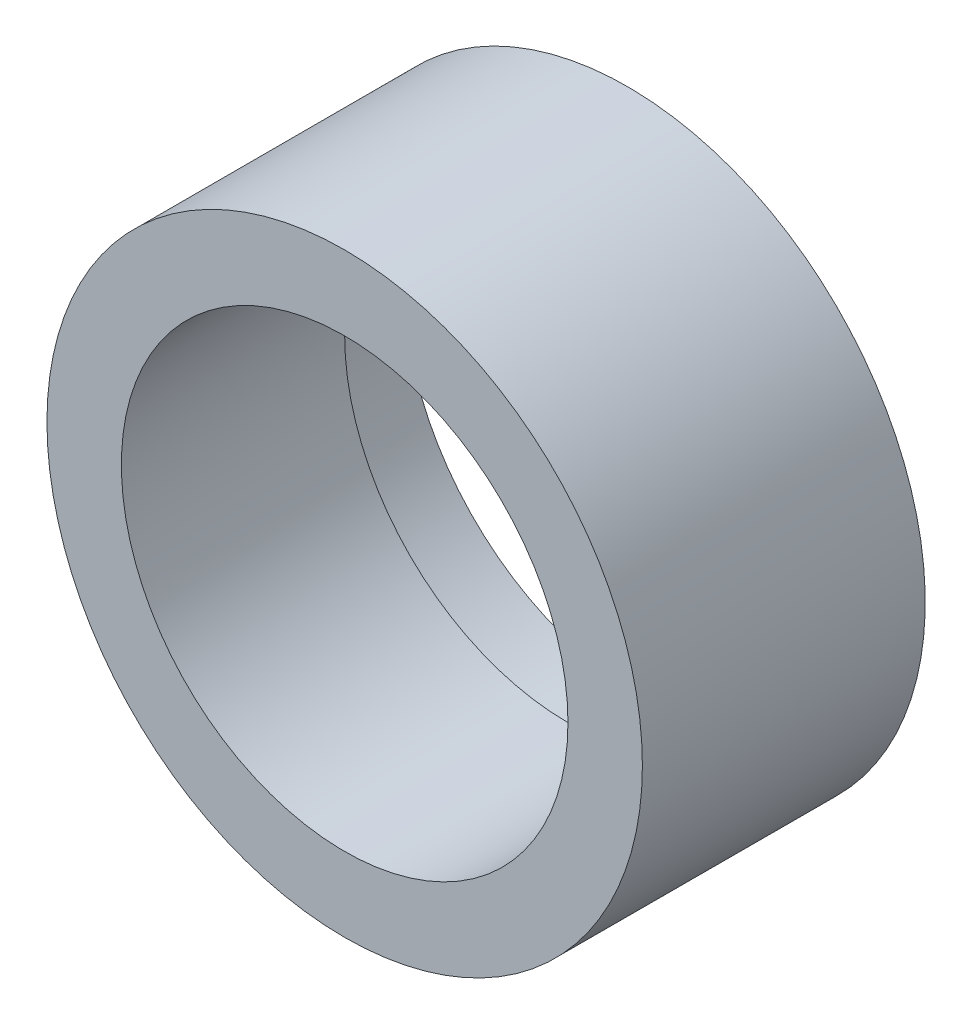
ISO-10303-21;
HEADER;
FILE_DESCRIPTION(('STEP AP214'),'2;1');
FILE_NAME('part.step','',(''),(''),'','','');
FILE_SCHEMA(('AUTOMOTIVE_DESIGN { 1 0 10303 214 1 1 1 1 }'));
ENDSEC;
DATA;
#1=APPLICATION_CONTEXT('core data for automotive mechanical design processes');
#2=APPLICATION_PROTOCOL_DEFINITION('international standard','automotive_design',2000,#1);
#3=PRODUCT_CONTEXT('',#1,'mechanical');
#4=PRODUCT('Part','Part','',(#3));
#5=PRODUCT_RELATED_PRODUCT_CATEGORY('part','',(#4));
#6=PRODUCT_DEFINITION_FORMATION('','',#4);
#7=PRODUCT_DEFINITION_CONTEXT('part definition',#1,'design');
#8=PRODUCT_DEFINITION('design','',#6,#7);
#9=PRODUCT_DEFINITION_SHAPE('','',#8);
#10=(LENGTH_UNIT() NAMED_UNIT(*) SI_UNIT(.MILLI.,.METRE.));
#11=(NAMED_UNIT(*) PLANE_ANGLE_UNIT() SI_UNIT($,.RADIAN.));
#12=(NAMED_UNIT(*) SI_UNIT($,.STERADIAN.) SOLID_ANGLE_UNIT());
#13=UNCERTAINTY_MEASURE_WITH_UNIT(LENGTH_MEASURE(1.E-05),#10,'distance_accuracy_value','');
#14=(GEOMETRIC_REPRESENTATION_CONTEXT(3) GLOBAL_UNCERTAINTY_ASSIGNED_CONTEXT((#13)) GLOBAL_UNIT_ASSIGNED_CONTEXT((#10,
#11,#12)) REPRESENTATION_CONTEXT('',''));
#15=CARTESIAN_POINT('',(0.,0.,0.));
#16=DIRECTION('',(0.,0.,1.));
#17=DIRECTION('',(1.,0.,0.));
#18=AXIS2_PLACEMENT_3D('',#15,#16,#17);
#19=CARTESIAN_POINT('',(0.,0.,20.));
#20=DIRECTION('',(0.,0.,-1.));
#21=DIRECTION('',(-1.,0.,0.));
#22=AXIS2_PLACEMENT_3D('',#19,#20,#21);
#23=CYLINDRICAL_SURFACE('',#22,20.);
#24=CARTESIAN_POINT('',(0.,0.,20.));
#25=DIRECTION('',(0.,0.,1.));
#26=DIRECTION('',(1.,0.,0.));
#27=AXIS2_PLACEMENT_3D('',#24,#25,#26);
#28=CIRCLE('',#27,20.);
#29=CARTESIAN_POINT('',(20.,0.,20.));
#30=VERTEX_POINT('',#29);
#31=EDGE_CURVE('E10',#30,#30,#28,.T.);
#32=ORIENTED_EDGE('',*,*,#31,.F.);
#33=EDGE_LOOP('',(#32));
#34=FACE_BOUND('',#33,.T.);
#35=CARTESIAN_POINT('',(0.,0.,1.));
#36=DIRECTION('',(0.,0.,-1.));
#37=DIRECTION('',(-1.,0.,0.));
#38=AXIS2_PLACEMENT_3D('',#35,#36,#37);
#39=CIRCLE('',#38,20.);
#40=CARTESIAN_POINT('',(-20.,0.,1.));
#41=VERTEX_POINT('',#40);
#42=EDGE_CURVE('E37',#41,#41,#39,.T.);
#43=ORIENTED_EDGE('',*,*,#42,.F.);
#44=EDGE_LOOP('',(#43));
#45=FACE_BOUND('',#44,.T.);
#46=ADVANCED_FACE('F30',(#34,#45),#23,.T.);
#47=CARTESIAN_POINT('',(0.,0.,20.));
#48=DIRECTION('',(0.,0.,1.));
#49=DIRECTION('',(1.,0.,0.));
#50=AXIS2_PLACEMENT_3D('',#47,#48,#49);
#51=PLANE('',#50);
#52=CARTESIAN_POINT('',(0.,0.,20.));
#53=DIRECTION('',(0.,0.,1.));
#54=DIRECTION('',(1.,0.,0.));
#55=AXIS2_PLACEMENT_3D('',#52,#53,#54);
#56=CIRCLE('',#55,15.);
#57=CARTESIAN_POINT('',(15.,0.,20.));
#58=VERTEX_POINT('',#57);
#59=EDGE_CURVE('E55',#58,#58,#56,.T.);
#60=ORIENTED_EDGE('',*,*,#59,.F.);
#61=EDGE_LOOP('',(#60));
#62=FACE_BOUND('',#61,.T.);
#63=ORIENTED_EDGE('',*,*,#31,.T.);
#64=EDGE_LOOP('',(#63));
#65=FACE_BOUND('',#64,.T.);
#66=ADVANCED_FACE('F89',(#62,#65),#51,.T.);
#67=CARTESIAN_POINT('',(0.,0.,1.));
#68=DIRECTION('',(0.,0.,-1.));
#69=DIRECTION('',(-1.,0.,0.));
#70=AXIS2_PLACEMENT_3D('',#67,#68,#69);
#71=PLANE('',#70);
#72=CARTESIAN_POINT('',(0.,0.,1.));
#73=DIRECTION('',(0.,0.,-1.));
#74=DIRECTION('',(-1.,0.,0.));
#75=AXIS2_PLACEMENT_3D('',#72,#73,#74);
#76=CIRCLE('',#75,18.5);
#77=CARTESIAN_POINT('',(-18.5,0.,1.));
#78=VERTEX_POINT('',#77);
#79=EDGE_CURVE('E41',#78,#78,#76,.T.);
#80=ORIENTED_EDGE('',*,*,#79,.F.);
#81=EDGE_LOOP('',(#80));
#82=FACE_BOUND('',#81,.T.);
#83=ORIENTED_EDGE('',*,*,#42,.T.);
#84=EDGE_LOOP('',(#83));
#85=FACE_BOUND('',#84,.T.);
#86=ADVANCED_FACE('F83',(#82,#85),#71,.T.);
#87=CARTESIAN_POINT('',(0.,0.,1.));
#88=DIRECTION('',(0.,0.,-1.));
#89=DIRECTION('',(-1.,0.,0.));
#90=AXIS2_PLACEMENT_3D('',#87,#88,#89);
#91=CYLINDRICAL_SURFACE('',#90,18.5);
#92=ORIENTED_EDGE('',*,*,#79,.T.);
#93=EDGE_LOOP('',(#92));
#94=FACE_BOUND('',#93,.T.);
#95=CARTESIAN_POINT('',(0.,0.,0.));
#96=DIRECTION('',(0.,0.,-1.));
#97=DIRECTION('',(-1.,0.,0.));
#98=AXIS2_PLACEMENT_3D('',#95,#96,#97);
#99=CIRCLE('',#98,18.5);
#100=CARTESIAN_POINT('',(-18.5,0.,0.));
#101=VERTEX_POINT('',#100);
#102=EDGE_CURVE('E44',#101,#101,#99,.T.);
#103=ORIENTED_EDGE('',*,*,#102,.F.);
#104=EDGE_LOOP('',(#103));
#105=FACE_BOUND('',#104,.T.);
#106=ADVANCED_FACE('F79',(#94,#105),#91,.T.);
#107=CARTESIAN_POINT('',(0.,0.,0.));
#108=DIRECTION('',(0.,0.,1.));
#109=DIRECTION('',(1.,0.,0.));
#110=AXIS2_PLACEMENT_3D('',#107,#108,#109);
#111=PLANE('',#110);
#112=CARTESIAN_POINT('',(0.,0.,0.));
#113=DIRECTION('',(0.,0.,-1.));
#114=DIRECTION('',(-1.,0.,0.));
#115=AXIS2_PLACEMENT_3D('',#112,#113,#114);
#116=CIRCLE('',#115,16.);
#117=CARTESIAN_POINT('',(-16.,0.,0.));
#118=VERTEX_POINT('',#117);
#119=EDGE_CURVE('E50',#118,#118,#116,.T.);
#120=ORIENTED_EDGE('',*,*,#119,.F.);
#121=EDGE_LOOP('',(#120));
#122=FACE_BOUND('',#121,.T.);
#123=ORIENTED_EDGE('',*,*,#102,.T.);
#124=EDGE_LOOP('',(#123));
#125=FACE_BOUND('',#124,.T.);
#126=ADVANCED_FACE('F73',(#122,#125),#111,.F.);
#127=CARTESIAN_POINT('',(0.,0.,5.));
#128=DIRECTION('',(0.,0.,-1.));
#129=DIRECTION('',(-1.,0.,0.));
#130=AXIS2_PLACEMENT_3D('',#127,#128,#129);
#131=CYLINDRICAL_SURFACE('',#130,16.);
#132=CARTESIAN_POINT('',(0.,0.,5.));
#133=DIRECTION('',(0.,0.,-1.));
#134=DIRECTION('',(-1.,0.,0.));
#135=AXIS2_PLACEMENT_3D('',#132,#133,#134);
#136=CIRCLE('',#135,16.);
#137=CARTESIAN_POINT('',(-16.,0.,5.));
#138=VERTEX_POINT('',#137);
#139=EDGE_CURVE('E47',#138,#138,#136,.T.);
#140=ORIENTED_EDGE('',*,*,#139,.F.);
#141=EDGE_LOOP('',(#140));
#142=FACE_BOUND('',#141,.T.);
#143=ORIENTED_EDGE('',*,*,#119,.T.);
#144=EDGE_LOOP('',(#143));
#145=FACE_BOUND('',#144,.T.);
#146=ADVANCED_FACE('F67',(#142,#145),#131,.F.);
#147=CARTESIAN_POINT('',(0.,0.,5.));
#148=DIRECTION('',(0.,0.,-1.));
#149=DIRECTION('',(-1.,0.,0.));
#150=AXIS2_PLACEMENT_3D('',#147,#148,#149);
#151=PLANE('',#150);
#152=CARTESIAN_POINT('',(0.,0.,5.));
#153=DIRECTION('',(0.,0.,-1.));
#154=DIRECTION('',(-1.,0.,0.));
#155=AXIS2_PLACEMENT_3D('',#152,#153,#154);
#156=CIRCLE('',#155,15.);
#157=CARTESIAN_POINT('',(-15.,0.,5.));
#158=VERTEX_POINT('',#157);
#159=EDGE_CURVE('E33',#158,#158,#156,.T.);
#160=ORIENTED_EDGE('',*,*,#159,.F.);
#161=EDGE_LOOP('',(#160));
#162=FACE_BOUND('',#161,.T.);
#163=ORIENTED_EDGE('',*,*,#139,.T.);
#164=EDGE_LOOP('',(#163));
#165=FACE_BOUND('',#164,.T.);
#166=ADVANCED_FACE('F64',(#162,#165),#151,.T.);
#167=CARTESIAN_POINT('',(0.,0.,0.));
#168=DIRECTION('',(0.,0.,1.));
#169=DIRECTION('',(1.,0.,0.));
#170=AXIS2_PLACEMENT_3D('',#167,#168,#169);
#171=CYLINDRICAL_SURFACE('',#170,15.);
#172=ORIENTED_EDGE('',*,*,#159,.T.);
#173=EDGE_LOOP('',(#172));
#174=FACE_BOUND('',#173,.T.);
#175=ORIENTED_EDGE('',*,*,#59,.T.);
#176=EDGE_LOOP('',(#175));
#177=FACE_BOUND('',#176,.T.);
#178=ADVANCED_FACE('F62',(#174,#177),#171,.F.);
#179=CLOSED_SHELL('',(#46,#66,#86,#106,#126,#146,#166,#178));
#180=MANIFOLD_SOLID_BREP('B2',#179);
#181=ADVANCED_BREP_SHAPE_REPRESENTATION('',(#18,#180),#14);
#182=SHAPE_DEFINITION_REPRESENTATION(#9,#181);
ENDSEC;
END-ISO-10303-21;
